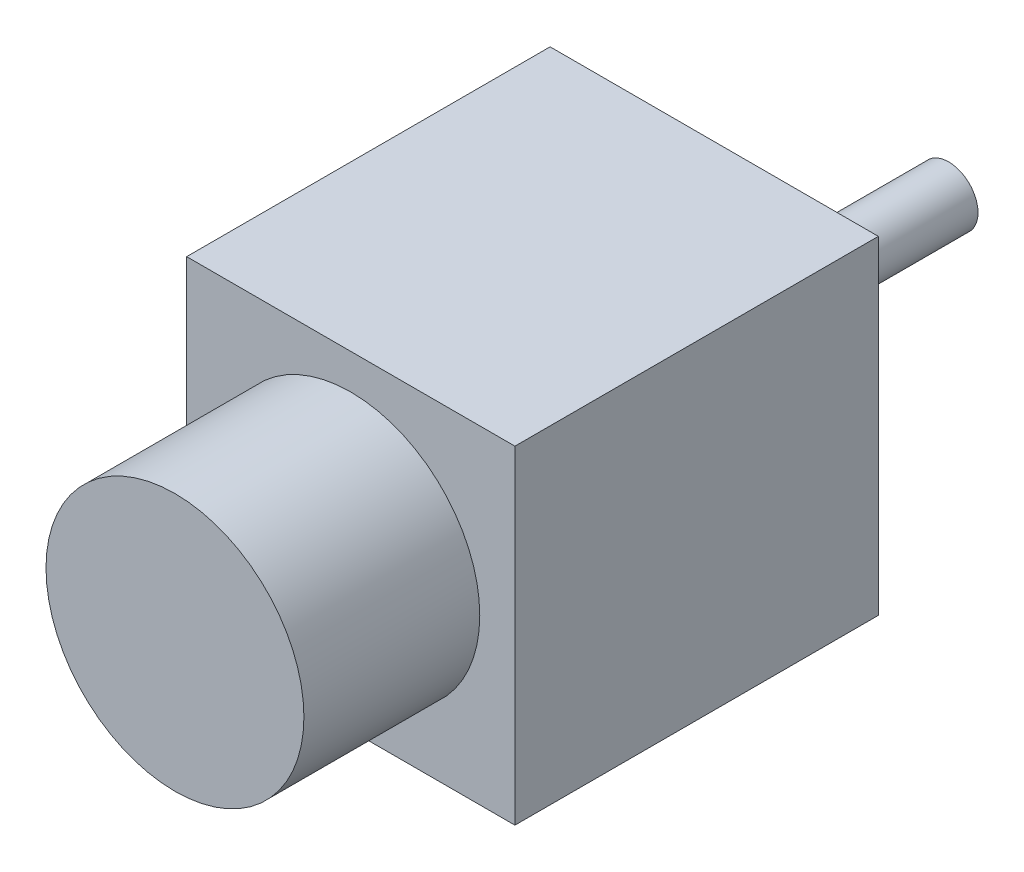
ISO-10303-21;
HEADER;
FILE_DESCRIPTION(('STEP AP214'),'2;1');
FILE_NAME('part.step','',(''),(''),'','','');
FILE_SCHEMA(('AUTOMOTIVE_DESIGN { 1 0 10303 214 1 1 1 1 }'));
ENDSEC;
DATA;
#1=APPLICATION_CONTEXT('core data for automotive mechanical design processes');
#2=APPLICATION_PROTOCOL_DEFINITION('international standard','automotive_design',2000,#1);
#3=PRODUCT_CONTEXT('',#1,'mechanical');
#4=PRODUCT('Part','Part','',(#3));
#5=PRODUCT_RELATED_PRODUCT_CATEGORY('part','',(#4));
#6=PRODUCT_DEFINITION_FORMATION('','',#4);
#7=PRODUCT_DEFINITION_CONTEXT('part definition',#1,'design');
#8=PRODUCT_DEFINITION('design','',#6,#7);
#9=PRODUCT_DEFINITION_SHAPE('','',#8);
#10=(LENGTH_UNIT() NAMED_UNIT(*) SI_UNIT(.MILLI.,.METRE.));
#11=(NAMED_UNIT(*) PLANE_ANGLE_UNIT() SI_UNIT($,.RADIAN.));
#12=(NAMED_UNIT(*) SI_UNIT($,.STERADIAN.) SOLID_ANGLE_UNIT());
#13=UNCERTAINTY_MEASURE_WITH_UNIT(LENGTH_MEASURE(1.E-05),#10,'distance_accuracy_value','');
#14=(GEOMETRIC_REPRESENTATION_CONTEXT(3) GLOBAL_UNCERTAINTY_ASSIGNED_CONTEXT((#13)) GLOBAL_UNIT_ASSIGNED_CONTEXT((#10,
#11,#12)) REPRESENTATION_CONTEXT('',''));
#15=CARTESIAN_POINT('',(0.,0.,0.));
#16=DIRECTION('',(0.,0.,1.));
#17=DIRECTION('',(1.,0.,0.));
#18=AXIS2_PLACEMENT_3D('',#15,#16,#17);
#19=CARTESIAN_POINT('',(0.,0.,46.));
#20=DIRECTION('',(1.,0.,0.));
#21=DIRECTION('',(0.,1.,0.));
#22=AXIS2_PLACEMENT_3D('',#19,#20,#21);
#23=PLANE('',#22);
#24=DIRECTION('',(0.,-1.,0.));
#25=VECTOR('',#24,1.);
#26=CARTESIAN_POINT('',(0.,0.,31.));
#27=LINE('',#26,#25);
#28=CARTESIAN_POINT('',(0.,0.,31.));
#29=VERTEX_POINT('',#28);
#30=CARTESIAN_POINT('',(0.,-28.,31.));
#31=VERTEX_POINT('',#30);
#32=EDGE_CURVE('E81',#29,#31,#27,.T.);
#33=ORIENTED_EDGE('',*,*,#32,.F.);
#34=DIRECTION('',(0.,0.,-1.));
#35=VECTOR('',#34,1.);
#36=CARTESIAN_POINT('',(0.,0.,46.));
#37=LINE('',#36,#35);
#38=CARTESIAN_POINT('',(0.,0.,0.));
#39=VERTEX_POINT('',#38);
#40=EDGE_CURVE('E62',#29,#39,#37,.T.);
#41=ORIENTED_EDGE('',*,*,#40,.T.);
#42=DIRECTION('',(0.,-1.,0.));
#43=VECTOR('',#42,1.);
#44=CARTESIAN_POINT('',(0.,0.,0.));
#45=LINE('',#44,#43);
#46=CARTESIAN_POINT('',(0.,-28.,0.));
#47=VERTEX_POINT('',#46);
#48=EDGE_CURVE('E118',#39,#47,#45,.T.);
#49=ORIENTED_EDGE('',*,*,#48,.T.);
#50=DIRECTION('',(0.,0.,-1.));
#51=VECTOR('',#50,1.);
#52=CARTESIAN_POINT('',(0.,-28.,46.));
#53=LINE('',#52,#51);
#54=EDGE_CURVE('E47',#31,#47,#53,.T.);
#55=ORIENTED_EDGE('',*,*,#54,.F.);
#56=EDGE_LOOP('',(#33,#41,#49,#55));
#57=FACE_BOUND('',#56,.T.);
#58=ADVANCED_FACE('F39',(#57),#23,.F.);
#59=CARTESIAN_POINT('',(0.,-28.,46.));
#60=DIRECTION('',(0.,1.,0.));
#61=DIRECTION('',(0.,0.,1.));
#62=AXIS2_PLACEMENT_3D('',#59,#60,#61);
#63=PLANE('',#62);
#64=DIRECTION('',(1.,0.,0.));
#65=VECTOR('',#64,1.);
#66=CARTESIAN_POINT('',(0.,-28.,31.));
#67=LINE('',#66,#65);
#68=CARTESIAN_POINT('',(28.,-28.,31.));
#69=VERTEX_POINT('',#68);
#70=EDGE_CURVE('E90',#31,#69,#67,.T.);
#71=ORIENTED_EDGE('',*,*,#70,.F.);
#72=ORIENTED_EDGE('',*,*,#54,.T.);
#73=DIRECTION('',(1.,0.,0.));
#74=VECTOR('',#73,1.);
#75=CARTESIAN_POINT('',(0.,-28.,0.));
#76=LINE('',#75,#74);
#77=CARTESIAN_POINT('',(28.,-28.,0.));
#78=VERTEX_POINT('',#77);
#79=EDGE_CURVE('E114',#47,#78,#76,.T.);
#80=ORIENTED_EDGE('',*,*,#79,.T.);
#81=DIRECTION('',(0.,0.,-1.));
#82=VECTOR('',#81,1.);
#83=CARTESIAN_POINT('',(28.,-28.,46.));
#84=LINE('',#83,#82);
#85=EDGE_CURVE('E101',#69,#78,#84,.T.);
#86=ORIENTED_EDGE('',*,*,#85,.F.);
#87=EDGE_LOOP('',(#71,#72,#80,#86));
#88=FACE_BOUND('',#87,.T.);
#89=ADVANCED_FACE('F112',(#88),#63,.F.);
#90=CARTESIAN_POINT('',(28.,0.,46.));
#91=DIRECTION('',(-1.,0.,0.));
#92=DIRECTION('',(0.,0.,1.));
#93=AXIS2_PLACEMENT_3D('',#90,#91,#92);
#94=PLANE('',#93);
#95=DIRECTION('',(0.,1.,0.));
#96=VECTOR('',#95,1.);
#97=CARTESIAN_POINT('',(28.,-28.,31.));
#98=LINE('',#97,#96);
#99=CARTESIAN_POINT('',(28.,0.,31.));
#100=VERTEX_POINT('',#99);
#101=EDGE_CURVE('E54',#69,#100,#98,.T.);
#102=ORIENTED_EDGE('',*,*,#101,.F.);
#103=ORIENTED_EDGE('',*,*,#85,.T.);
#104=DIRECTION('',(0.,1.,0.));
#105=VECTOR('',#104,1.);
#106=CARTESIAN_POINT('',(28.,0.,0.));
#107=LINE('',#106,#105);
#108=CARTESIAN_POINT('',(28.,0.,0.));
#109=VERTEX_POINT('',#108);
#110=EDGE_CURVE('E103',#78,#109,#107,.T.);
#111=ORIENTED_EDGE('',*,*,#110,.T.);
#112=DIRECTION('',(0.,0.,-1.));
#113=VECTOR('',#112,1.);
#114=CARTESIAN_POINT('',(28.,0.,46.));
#115=LINE('',#114,#113);
#116=EDGE_CURVE('E97',#100,#109,#115,.T.);
#117=ORIENTED_EDGE('',*,*,#116,.F.);
#118=EDGE_LOOP('',(#102,#103,#111,#117));
#119=FACE_BOUND('',#118,.T.);
#120=ADVANCED_FACE('F129',(#119),#94,.F.);
#121=CARTESIAN_POINT('',(0.,0.,46.));
#122=DIRECTION('',(0.,-1.,0.));
#123=DIRECTION('',(0.,0.,-1.));
#124=AXIS2_PLACEMENT_3D('',#121,#122,#123);
#125=PLANE('',#124);
#126=DIRECTION('',(-1.,0.,0.));
#127=VECTOR('',#126,1.);
#128=CARTESIAN_POINT('',(28.,0.,31.));
#129=LINE('',#128,#127);
#130=EDGE_CURVE('E79',#100,#29,#129,.T.);
#131=ORIENTED_EDGE('',*,*,#130,.F.);
#132=ORIENTED_EDGE('',*,*,#116,.T.);
#133=DIRECTION('',(-1.,0.,0.));
#134=VECTOR('',#133,1.);
#135=CARTESIAN_POINT('',(0.,0.,0.));
#136=LINE('',#135,#134);
#137=EDGE_CURVE('E94',#109,#39,#136,.T.);
#138=ORIENTED_EDGE('',*,*,#137,.T.);
#139=ORIENTED_EDGE('',*,*,#40,.F.);
#140=EDGE_LOOP('',(#131,#132,#138,#139));
#141=FACE_BOUND('',#140,.T.);
#142=ADVANCED_FACE('F92',(#141),#125,.F.);
#143=CARTESIAN_POINT('',(0.,0.,0.));
#144=DIRECTION('',(0.,0.,1.));
#145=DIRECTION('',(1.,0.,0.));
#146=AXIS2_PLACEMENT_3D('',#143,#144,#145);
#147=PLANE('',#146);
#148=CARTESIAN_POINT('',(14.,-14.,0.));
#149=DIRECTION('',(0.,0.,1.));
#150=DIRECTION('',(1.,0.,0.));
#151=AXIS2_PLACEMENT_3D('',#148,#149,#150);
#152=CIRCLE('',#151,2.5);
#153=CARTESIAN_POINT('',(16.5,-14.,0.));
#154=VERTEX_POINT('',#153);
#155=EDGE_CURVE('E11',#154,#154,#152,.F.);
#156=ORIENTED_EDGE('',*,*,#155,.F.);
#157=EDGE_LOOP('',(#156));
#158=FACE_BOUND('',#157,.T.);
#159=ORIENTED_EDGE('',*,*,#48,.F.);
#160=ORIENTED_EDGE('',*,*,#137,.F.);
#161=ORIENTED_EDGE('',*,*,#110,.F.);
#162=ORIENTED_EDGE('',*,*,#79,.F.);
#163=EDGE_LOOP('',(#159,#160,#161,#162));
#164=FACE_BOUND('',#163,.T.);
#165=ADVANCED_FACE('F117',(#158,#164),#147,.F.);
#166=CARTESIAN_POINT('',(0.,0.,31.));
#167=DIRECTION('',(0.,0.,1.));
#168=DIRECTION('',(1.,0.,0.));
#169=AXIS2_PLACEMENT_3D('',#166,#167,#168);
#170=PLANE('',#169);
#171=CARTESIAN_POINT('',(14.,-14.,31.));
#172=DIRECTION('',(0.,0.,1.));
#173=DIRECTION('',(1.,0.,0.));
#174=AXIS2_PLACEMENT_3D('',#171,#172,#173);
#175=CIRCLE('',#174,11.);
#176=CARTESIAN_POINT('',(25.,-14.,31.));
#177=VERTEX_POINT('',#176);
#178=EDGE_CURVE('E86',#177,#177,#175,.T.);
#179=ORIENTED_EDGE('',*,*,#178,.F.);
#180=EDGE_LOOP('',(#179));
#181=FACE_BOUND('',#180,.T.);
#182=ORIENTED_EDGE('',*,*,#130,.T.);
#183=ORIENTED_EDGE('',*,*,#32,.T.);
#184=ORIENTED_EDGE('',*,*,#70,.T.);
#185=ORIENTED_EDGE('',*,*,#101,.T.);
#186=EDGE_LOOP('',(#182,#183,#184,#185));
#187=FACE_BOUND('',#186,.T.);
#188=ADVANCED_FACE('F80',(#181,#187),#170,.T.);
#189=CARTESIAN_POINT('',(14.,-14.,31.));
#190=DIRECTION('',(0.,0.,1.));
#191=DIRECTION('',(1.,0.,0.));
#192=AXIS2_PLACEMENT_3D('',#189,#190,#191);
#193=CYLINDRICAL_SURFACE('',#192,11.);
#194=ORIENTED_EDGE('',*,*,#178,.T.);
#195=EDGE_LOOP('',(#194));
#196=FACE_BOUND('',#195,.T.);
#197=CARTESIAN_POINT('',(14.,-14.,46.));
#198=DIRECTION('',(0.,0.,1.));
#199=DIRECTION('',(1.,0.,0.));
#200=AXIS2_PLACEMENT_3D('',#197,#198,#199);
#201=CIRCLE('',#200,11.);
#202=CARTESIAN_POINT('',(25.,-14.,46.));
#203=VERTEX_POINT('',#202);
#204=EDGE_CURVE('E220',#203,#203,#201,.T.);
#205=ORIENTED_EDGE('',*,*,#204,.F.);
#206=EDGE_LOOP('',(#205));
#207=FACE_BOUND('',#206,.T.);
#208=ADVANCED_FACE('F165',(#196,#207),#193,.T.);
#209=CARTESIAN_POINT('',(0.,0.,46.));
#210=DIRECTION('',(0.,0.,1.));
#211=DIRECTION('',(1.,0.,0.));
#212=AXIS2_PLACEMENT_3D('',#209,#210,#211);
#213=PLANE('',#212);
#214=ORIENTED_EDGE('',*,*,#204,.T.);
#215=EDGE_LOOP('',(#214));
#216=FACE_BOUND('',#215,.T.);
#217=ADVANCED_FACE('F175',(#216),#213,.T.);
#218=CARTESIAN_POINT('',(14.,-14.,-20.));
#219=DIRECTION('',(0.,0.,1.));
#220=DIRECTION('',(1.,0.,0.));
#221=AXIS2_PLACEMENT_3D('',#218,#219,#220);
#222=CYLINDRICAL_SURFACE('',#221,2.5);
#223=CARTESIAN_POINT('',(14.,-14.,-20.));
#224=DIRECTION('',(0.,0.,-1.));
#225=DIRECTION('',(-1.,0.,0.));
#226=AXIS2_PLACEMENT_3D('',#223,#224,#225);
#227=CIRCLE('',#226,2.5);
#228=CARTESIAN_POINT('',(11.5,-14.,-20.));
#229=VERTEX_POINT('',#228);
#230=EDGE_CURVE('E218',#229,#229,#227,.T.);
#231=ORIENTED_EDGE('',*,*,#230,.F.);
#232=EDGE_LOOP('',(#231));
#233=FACE_BOUND('',#232,.T.);
#234=ORIENTED_EDGE('',*,*,#155,.T.);
#235=EDGE_LOOP('',(#234));
#236=FACE_BOUND('',#235,.T.);
#237=ADVANCED_FACE('F185',(#233,#236),#222,.T.);
#238=CARTESIAN_POINT('',(0.,0.,-20.));
#239=DIRECTION('',(0.,0.,-1.));
#240=DIRECTION('',(-1.,0.,0.));
#241=AXIS2_PLACEMENT_3D('',#238,#239,#240);
#242=PLANE('',#241);
#243=ORIENTED_EDGE('',*,*,#230,.T.);
#244=EDGE_LOOP('',(#243));
#245=FACE_BOUND('',#244,.T.);
#246=ADVANCED_FACE('F202',(#245),#242,.T.);
#247=CLOSED_SHELL('',(#58,#89,#120,#142,#165,#188,#208,#217,#237,#246));
#248=MANIFOLD_SOLID_BREP('B2',#247);
#249=ADVANCED_BREP_SHAPE_REPRESENTATION('',(#18,#248),#14);
#250=SHAPE_DEFINITION_REPRESENTATION(#9,#249);
ENDSEC;
END-ISO-10303-21;
